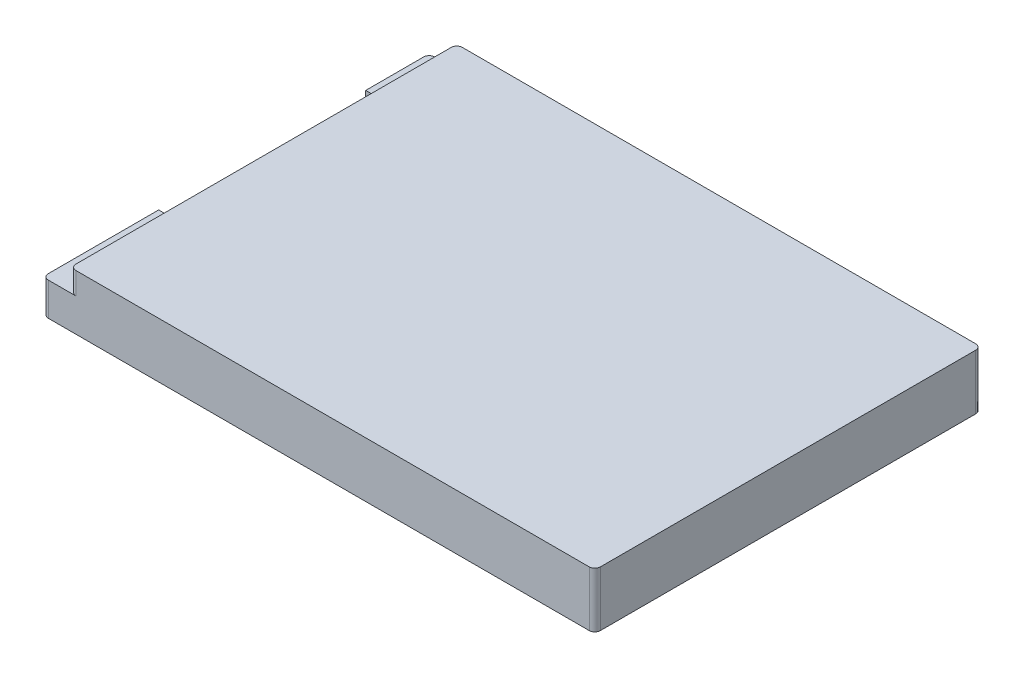
ISO-10303-21;
HEADER;
FILE_DESCRIPTION(('STEP AP214'),'2;1');
FILE_NAME('part.step','',(''),(''),'','','');
FILE_SCHEMA(('AUTOMOTIVE_DESIGN { 1 0 10303 214 1 1 1 1 }'));
ENDSEC;
DATA;
#1=APPLICATION_CONTEXT('core data for automotive mechanical design processes');
#2=APPLICATION_PROTOCOL_DEFINITION('international standard','automotive_design',2000,#1);
#3=PRODUCT_CONTEXT('',#1,'mechanical');
#4=PRODUCT('Part','Part','',(#3));
#5=PRODUCT_RELATED_PRODUCT_CATEGORY('part','',(#4));
#6=PRODUCT_DEFINITION_FORMATION('','',#4);
#7=PRODUCT_DEFINITION_CONTEXT('part definition',#1,'design');
#8=PRODUCT_DEFINITION('design','',#6,#7);
#9=PRODUCT_DEFINITION_SHAPE('','',#8);
#10=(LENGTH_UNIT() NAMED_UNIT(*) SI_UNIT(.MILLI.,.METRE.));
#11=(NAMED_UNIT(*) PLANE_ANGLE_UNIT() SI_UNIT($,.RADIAN.));
#12=(NAMED_UNIT(*) SI_UNIT($,.STERADIAN.) SOLID_ANGLE_UNIT());
#13=UNCERTAINTY_MEASURE_WITH_UNIT(LENGTH_MEASURE(1.E-05),#10,'distance_accuracy_value','');
#14=(GEOMETRIC_REPRESENTATION_CONTEXT(3) GLOBAL_UNCERTAINTY_ASSIGNED_CONTEXT((#13)) GLOBAL_UNIT_ASSIGNED_CONTEXT((#10,
#11,#12)) REPRESENTATION_CONTEXT('',''));
#15=CARTESIAN_POINT('',(0.,0.,0.));
#16=DIRECTION('',(0.,0.,1.));
#17=DIRECTION('',(1.,0.,0.));
#18=AXIS2_PLACEMENT_3D('',#15,#16,#17);
#19=CARTESIAN_POINT('',(0.,10.,0.));
#20=DIRECTION('',(1.,0.,0.));
#21=DIRECTION('',(0.,0.,-1.));
#22=AXIS2_PLACEMENT_3D('',#19,#20,#21);
#23=PLANE('',#22);
#24=DIRECTION('',(0.,0.,1.));
#25=VECTOR('',#24,1.);
#26=CARTESIAN_POINT('',(0.,0.,0.));
#27=LINE('',#26,#25);
#28=CARTESIAN_POINT('',(0.,0.,-21.));
#29=VERTEX_POINT('',#28);
#30=CARTESIAN_POINT('',(0.,0.,-1.));
#31=VERTEX_POINT('',#30);
#32=EDGE_CURVE('E336',#29,#31,#27,.T.);
#33=ORIENTED_EDGE('',*,*,#32,.T.);
#34=DIRECTION('',(0.,-1.,0.));
#35=VECTOR('',#34,1.);
#36=CARTESIAN_POINT('',(0.,10.,-1.));
#37=LINE('',#36,#35);
#38=CARTESIAN_POINT('',(0.,6.,-1.));
#39=VERTEX_POINT('',#38);
#40=EDGE_CURVE('E55',#31,#39,#37,.F.);
#41=ORIENTED_EDGE('',*,*,#40,.T.);
#42=DIRECTION('',(0.,0.,1.));
#43=VECTOR('',#42,1.);
#44=CARTESIAN_POINT('',(0.,6.,0.));
#45=LINE('',#44,#43);
#46=CARTESIAN_POINT('',(0.,6.,-21.));
#47=VERTEX_POINT('',#46);
#48=EDGE_CURVE('E277',#47,#39,#45,.T.);
#49=ORIENTED_EDGE('',*,*,#48,.F.);
#50=DIRECTION('',(0.,1.,0.));
#51=VECTOR('',#50,1.);
#52=CARTESIAN_POINT('',(0.,6.,-21.));
#53=LINE('',#52,#51);
#54=EDGE_CURVE('E296',#29,#47,#53,.T.);
#55=ORIENTED_EDGE('',*,*,#54,.F.);
#56=EDGE_LOOP('',(#33,#41,#49,#55));
#57=FACE_BOUND('',#56,.T.);
#58=ADVANCED_FACE('F32',(#57),#23,.F.);
#59=DIRECTION('',(0.,0.,1.));
#60=VECTOR('',#59,1.);
#61=CARTESIAN_POINT('',(0.,5.99999999999999,-58.5));
#62=LINE('',#61,#60);
#63=CARTESIAN_POINT('',(0.,5.99999999999999,-69.));
#64=VERTEX_POINT('',#63);
#65=CARTESIAN_POINT('',(0.,5.99999999999999,-58.5));
#66=VERTEX_POINT('',#65);
#67=EDGE_CURVE('E267',#64,#66,#62,.T.);
#68=ORIENTED_EDGE('',*,*,#67,.F.);
#69=DIRECTION('',(0.,-1.,0.));
#70=VECTOR('',#69,1.);
#71=CARTESIAN_POINT('',(0.,10.,-69.));
#72=LINE('',#71,#70);
#73=CARTESIAN_POINT('',(0.,0.,-69.));
#74=VERTEX_POINT('',#73);
#75=EDGE_CURVE('E404',#64,#74,#72,.T.);
#76=ORIENTED_EDGE('',*,*,#75,.T.);
#77=CARTESIAN_POINT('',(0.,0.,-58.5));
#78=VERTEX_POINT('',#77);
#79=EDGE_CURVE('E350',#74,#78,#27,.T.);
#80=ORIENTED_EDGE('',*,*,#79,.T.);
#81=DIRECTION('',(0.,-1.,0.));
#82=VECTOR('',#81,1.);
#83=CARTESIAN_POINT('',(0.,0.,-58.5));
#84=LINE('',#83,#82);
#85=EDGE_CURVE('E293',#66,#78,#84,.T.);
#86=ORIENTED_EDGE('',*,*,#85,.F.);
#87=EDGE_LOOP('',(#68,#76,#80,#86));
#88=FACE_BOUND('',#87,.T.);
#89=ADVANCED_FACE('F472',(#88),#23,.F.);
#90=CARTESIAN_POINT('',(0.,10.,0.));
#91=DIRECTION('',(0.,0.,-1.));
#92=DIRECTION('',(-1.,0.,0.));
#93=AXIS2_PLACEMENT_3D('',#90,#91,#92);
#94=PLANE('',#93);
#95=DIRECTION('',(1.,0.,0.));
#96=VECTOR('',#95,1.);
#97=CARTESIAN_POINT('',(0.,0.,0.));
#98=LINE('',#97,#96);
#99=CARTESIAN_POINT('',(1.,0.,0.));
#100=VERTEX_POINT('',#99);
#101=CARTESIAN_POINT('',(99.,0.,0.));
#102=VERTEX_POINT('',#101);
#103=EDGE_CURVE('E352',#100,#102,#98,.T.);
#104=ORIENTED_EDGE('',*,*,#103,.T.);
#105=DIRECTION('',(0.,-1.,0.));
#106=VECTOR('',#105,1.);
#107=CARTESIAN_POINT('',(99.,10.,0.));
#108=LINE('',#107,#106);
#109=CARTESIAN_POINT('',(99.,10.,0.));
#110=VERTEX_POINT('',#109);
#111=EDGE_CURVE('E393',#102,#110,#108,.F.);
#112=ORIENTED_EDGE('',*,*,#111,.T.);
#113=DIRECTION('',(1.,0.,0.));
#114=VECTOR('',#113,1.);
#115=CARTESIAN_POINT('',(0.,10.,0.));
#116=LINE('',#115,#114);
#117=CARTESIAN_POINT('',(6.,10.,0.));
#118=VERTEX_POINT('',#117);
#119=EDGE_CURVE('E339',#118,#110,#116,.T.);
#120=ORIENTED_EDGE('',*,*,#119,.F.);
#121=DIRECTION('',(0.,1.,0.));
#122=VECTOR('',#121,1.);
#123=CARTESIAN_POINT('',(6.,10.,0.));
#124=LINE('',#123,#122);
#125=CARTESIAN_POINT('',(6.,6.,0.));
#126=VERTEX_POINT('',#125);
#127=EDGE_CURVE('E390',#118,#126,#124,.F.);
#128=ORIENTED_EDGE('',*,*,#127,.T.);
#129=DIRECTION('',(-1.,0.,0.));
#130=VECTOR('',#129,1.);
#131=CARTESIAN_POINT('',(5.,6.,0.));
#132=LINE('',#131,#130);
#133=CARTESIAN_POINT('',(1.,6.,0.));
#134=VERTEX_POINT('',#133);
#135=EDGE_CURVE('E303',#126,#134,#132,.T.);
#136=ORIENTED_EDGE('',*,*,#135,.T.);
#137=DIRECTION('',(0.,-1.,0.));
#138=VECTOR('',#137,1.);
#139=CARTESIAN_POINT('',(1.,10.,0.));
#140=LINE('',#139,#138);
#141=EDGE_CURVE('E387',#134,#100,#140,.T.);
#142=ORIENTED_EDGE('',*,*,#141,.T.);
#143=EDGE_LOOP('',(#104,#112,#120,#128,#136,#142));
#144=FACE_BOUND('',#143,.T.);
#145=ADVANCED_FACE('F422',(#144),#94,.F.);
#146=CARTESIAN_POINT('',(100.,10.,0.));
#147=DIRECTION('',(-1.,0.,0.));
#148=DIRECTION('',(0.,0.,1.));
#149=AXIS2_PLACEMENT_3D('',#146,#147,#148);
#150=PLANE('',#149);
#151=DIRECTION('',(0.,0.,-1.));
#152=VECTOR('',#151,1.);
#153=CARTESIAN_POINT('',(100.,0.,0.));
#154=LINE('',#153,#152);
#155=CARTESIAN_POINT('',(100.,0.,-1.));
#156=VERTEX_POINT('',#155);
#157=CARTESIAN_POINT('',(100.,0.,-69.));
#158=VERTEX_POINT('',#157);
#159=EDGE_CURVE('E355',#156,#158,#154,.T.);
#160=ORIENTED_EDGE('',*,*,#159,.T.);
#161=DIRECTION('',(0.,-1.,0.));
#162=VECTOR('',#161,1.);
#163=CARTESIAN_POINT('',(100.,10.,-69.));
#164=LINE('',#163,#162);
#165=CARTESIAN_POINT('',(100.,10.,-69.));
#166=VERTEX_POINT('',#165);
#167=EDGE_CURVE('E377',#158,#166,#164,.F.);
#168=ORIENTED_EDGE('',*,*,#167,.T.);
#169=DIRECTION('',(0.,0.,-1.));
#170=VECTOR('',#169,1.);
#171=CARTESIAN_POINT('',(100.,10.,0.));
#172=LINE('',#171,#170);
#173=CARTESIAN_POINT('',(100.,10.,-1.));
#174=VERTEX_POINT('',#173);
#175=EDGE_CURVE('E342',#174,#166,#172,.T.);
#176=ORIENTED_EDGE('',*,*,#175,.F.);
#177=DIRECTION('',(0.,-1.,0.));
#178=VECTOR('',#177,1.);
#179=CARTESIAN_POINT('',(100.,10.,-1.));
#180=LINE('',#179,#178);
#181=EDGE_CURVE('E374',#174,#156,#180,.T.);
#182=ORIENTED_EDGE('',*,*,#181,.T.);
#183=EDGE_LOOP('',(#160,#168,#176,#182));
#184=FACE_BOUND('',#183,.T.);
#185=ADVANCED_FACE('F431',(#184),#150,.F.);
#186=CARTESIAN_POINT('',(0.,10.,-70.));
#187=DIRECTION('',(0.,0.,1.));
#188=DIRECTION('',(1.,0.,0.));
#189=AXIS2_PLACEMENT_3D('',#186,#187,#188);
#190=PLANE('',#189);
#191=DIRECTION('',(-1.,0.,0.));
#192=VECTOR('',#191,1.);
#193=CARTESIAN_POINT('',(0.,10.,-70.));
#194=LINE('',#193,#192);
#195=CARTESIAN_POINT('',(99.,10.,-70.));
#196=VERTEX_POINT('',#195);
#197=CARTESIAN_POINT('',(6.,10.,-70.));
#198=VERTEX_POINT('',#197);
#199=EDGE_CURVE('E346',#196,#198,#194,.T.);
#200=ORIENTED_EDGE('',*,*,#199,.F.);
#201=DIRECTION('',(0.,-1.,0.));
#202=VECTOR('',#201,1.);
#203=CARTESIAN_POINT('',(99.,10.,-70.));
#204=LINE('',#203,#202);
#205=CARTESIAN_POINT('',(99.,0.,-70.));
#206=VERTEX_POINT('',#205);
#207=EDGE_CURVE('E363',#196,#206,#204,.T.);
#208=ORIENTED_EDGE('',*,*,#207,.T.);
#209=DIRECTION('',(-1.,0.,0.));
#210=VECTOR('',#209,1.);
#211=CARTESIAN_POINT('',(0.,0.,-70.));
#212=LINE('',#211,#210);
#213=CARTESIAN_POINT('',(1.,0.,-70.));
#214=VERTEX_POINT('',#213);
#215=EDGE_CURVE('E343',#206,#214,#212,.T.);
#216=ORIENTED_EDGE('',*,*,#215,.T.);
#217=DIRECTION('',(0.,-1.,0.));
#218=VECTOR('',#217,1.);
#219=CARTESIAN_POINT('',(1.,10.,-70.));
#220=LINE('',#219,#218);
#221=CARTESIAN_POINT('',(1.,5.99999999999999,-70.));
#222=VERTEX_POINT('',#221);
#223=EDGE_CURVE('E349',#214,#222,#220,.F.);
#224=ORIENTED_EDGE('',*,*,#223,.T.);
#225=DIRECTION('',(-1.,0.,0.));
#226=VECTOR('',#225,1.);
#227=CARTESIAN_POINT('',(5.,5.99999999999999,-70.));
#228=LINE('',#227,#226);
#229=CARTESIAN_POINT('',(6.,5.99999999999999,-70.));
#230=VERTEX_POINT('',#229);
#231=EDGE_CURVE('E300',#230,#222,#228,.T.);
#232=ORIENTED_EDGE('',*,*,#231,.F.);
#233=DIRECTION('',(0.,-1.,0.));
#234=VECTOR('',#233,1.);
#235=CARTESIAN_POINT('',(6.,10.,-70.));
#236=LINE('',#235,#234);
#237=EDGE_CURVE('E361',#230,#198,#236,.F.);
#238=ORIENTED_EDGE('',*,*,#237,.T.);
#239=EDGE_LOOP('',(#200,#208,#216,#224,#232,#238));
#240=FACE_BOUND('',#239,.T.);
#241=ADVANCED_FACE('F440',(#240),#190,.F.);
#242=CARTESIAN_POINT('',(0.,10.,-70.));
#243=DIRECTION('',(0.,-1.,0.));
#244=DIRECTION('',(0.,0.,-1.));
#245=AXIS2_PLACEMENT_3D('',#242,#243,#244);
#246=PLANE('',#245);
#247=ORIENTED_EDGE('',*,*,#175,.T.);
#248=CARTESIAN_POINT('',(99.,10.,-69.));
#249=DIRECTION('',(0.,-1.,0.));
#250=DIRECTION('',(0.,0.,-1.));
#251=AXIS2_PLACEMENT_3D('',#248,#249,#250);
#252=CIRCLE('',#251,1.);
#253=EDGE_CURVE('E385',#166,#196,#252,.F.);
#254=ORIENTED_EDGE('',*,*,#253,.T.);
#255=ORIENTED_EDGE('',*,*,#199,.T.);
#256=CARTESIAN_POINT('',(6.,10.,-69.));
#257=DIRECTION('',(0.,-1.,0.));
#258=DIRECTION('',(0.,0.,-1.));
#259=AXIS2_PLACEMENT_3D('',#256,#257,#258);
#260=CIRCLE('',#259,1.);
#261=CARTESIAN_POINT('',(5.,10.,-69.));
#262=VERTEX_POINT('',#261);
#263=EDGE_CURVE('E379',#198,#262,#260,.F.);
#264=ORIENTED_EDGE('',*,*,#263,.T.);
#265=DIRECTION('',(0.,0.,-1.));
#266=VECTOR('',#265,1.);
#267=CARTESIAN_POINT('',(5.,10.,-70.));
#268=LINE('',#267,#266);
#269=CARTESIAN_POINT('',(5.,10.,-1.));
#270=VERTEX_POINT('',#269);
#271=EDGE_CURVE('E288',#270,#262,#268,.T.);
#272=ORIENTED_EDGE('',*,*,#271,.F.);
#273=CARTESIAN_POINT('',(6.,10.,-1.));
#274=DIRECTION('',(0.,-1.,0.));
#275=DIRECTION('',(0.,0.,-1.));
#276=AXIS2_PLACEMENT_3D('',#273,#274,#275);
#277=CIRCLE('',#276,1.);
#278=EDGE_CURVE('E381',#270,#118,#277,.F.);
#279=ORIENTED_EDGE('',*,*,#278,.T.);
#280=ORIENTED_EDGE('',*,*,#119,.T.);
#281=CARTESIAN_POINT('',(99.,10.,-1.));
#282=DIRECTION('',(0.,-1.,0.));
#283=DIRECTION('',(0.,0.,-1.));
#284=AXIS2_PLACEMENT_3D('',#281,#282,#283);
#285=CIRCLE('',#284,1.);
#286=EDGE_CURVE('E383',#110,#174,#285,.F.);
#287=ORIENTED_EDGE('',*,*,#286,.T.);
#288=EDGE_LOOP('',(#247,#254,#255,#264,#272,#279,#280,#287));
#289=FACE_BOUND('',#288,.T.);
#290=ADVANCED_FACE('F419',(#289),#246,.F.);
#291=CARTESIAN_POINT('',(0.,0.,-70.));
#292=DIRECTION('',(0.,-1.,0.));
#293=DIRECTION('',(0.,0.,-1.));
#294=AXIS2_PLACEMENT_3D('',#291,#292,#293);
#295=PLANE('',#294);
#296=ORIENTED_EDGE('',*,*,#215,.F.);
#297=CARTESIAN_POINT('',(99.,0.,-69.));
#298=DIRECTION('',(0.,-1.,0.));
#299=DIRECTION('',(0.,0.,-1.));
#300=AXIS2_PLACEMENT_3D('',#297,#298,#299);
#301=CIRCLE('',#300,1.);
#302=EDGE_CURVE('E372',#206,#158,#301,.T.);
#303=ORIENTED_EDGE('',*,*,#302,.T.);
#304=ORIENTED_EDGE('',*,*,#159,.F.);
#305=CARTESIAN_POINT('',(99.,0.,-1.));
#306=DIRECTION('',(0.,-1.,0.));
#307=DIRECTION('',(0.,0.,-1.));
#308=AXIS2_PLACEMENT_3D('',#305,#306,#307);
#309=CIRCLE('',#308,1.);
#310=EDGE_CURVE('E370',#156,#102,#309,.T.);
#311=ORIENTED_EDGE('',*,*,#310,.T.);
#312=ORIENTED_EDGE('',*,*,#103,.F.);
#313=CARTESIAN_POINT('',(1.,0.,-1.));
#314=DIRECTION('',(0.,-1.,0.));
#315=DIRECTION('',(0.,0.,-1.));
#316=AXIS2_PLACEMENT_3D('',#313,#314,#315);
#317=CIRCLE('',#316,1.);
#318=EDGE_CURVE('E368',#100,#31,#317,.T.);
#319=ORIENTED_EDGE('',*,*,#318,.T.);
#320=ORIENTED_EDGE('',*,*,#32,.F.);
#321=DIRECTION('',(-1.,0.,0.));
#322=VECTOR('',#321,1.);
#323=CARTESIAN_POINT('',(5.,0.,-21.));
#324=LINE('',#323,#322);
#325=CARTESIAN_POINT('',(5.,0.,-21.));
#326=VERTEX_POINT('',#325);
#327=EDGE_CURVE('E308',#326,#29,#324,.T.);
#328=ORIENTED_EDGE('',*,*,#327,.F.);
#329=DIRECTION('',(0.,0.,1.));
#330=VECTOR('',#329,1.);
#331=CARTESIAN_POINT('',(5.,0.,-21.));
#332=LINE('',#331,#330);
#333=CARTESIAN_POINT('',(5.,0.,-58.5));
#334=VERTEX_POINT('',#333);
#335=EDGE_CURVE('E279',#334,#326,#332,.T.);
#336=ORIENTED_EDGE('',*,*,#335,.F.);
#337=DIRECTION('',(-1.,0.,0.));
#338=VECTOR('',#337,1.);
#339=CARTESIAN_POINT('',(5.,0.,-58.5));
#340=LINE('',#339,#338);
#341=EDGE_CURVE('E310',#334,#78,#340,.T.);
#342=ORIENTED_EDGE('',*,*,#341,.T.);
#343=ORIENTED_EDGE('',*,*,#79,.F.);
#344=CARTESIAN_POINT('',(1.,0.,-69.));
#345=DIRECTION('',(0.,-1.,0.));
#346=DIRECTION('',(0.,0.,-1.));
#347=AXIS2_PLACEMENT_3D('',#344,#345,#346);
#348=CIRCLE('',#347,1.);
#349=EDGE_CURVE('E366',#74,#214,#348,.T.);
#350=ORIENTED_EDGE('',*,*,#349,.T.);
#351=EDGE_LOOP('',(#296,#303,#304,#311,#312,#319,#320,#328,#336,#342,#343,#350));
#352=FACE_BOUND('',#351,.T.);
#353=CARTESIAN_POINT('',(91.,0.,-4.));
#354=DIRECTION('',(0.,-1.,0.));
#355=DIRECTION('',(0.,0.,-1.));
#356=AXIS2_PLACEMENT_3D('',#353,#354,#355);
#357=CIRCLE('',#356,1.5);
#358=CARTESIAN_POINT('',(91.,0.,-5.5));
#359=VERTEX_POINT('',#358);
#360=EDGE_CURVE('E302',#359,#359,#357,.T.);
#361=ORIENTED_EDGE('',*,*,#360,.F.);
#362=EDGE_LOOP('',(#361));
#363=FACE_BOUND('',#362,.T.);
#364=CARTESIAN_POINT('',(91.,0.,-66.));
#365=DIRECTION('',(0.,-1.,0.));
#366=DIRECTION('',(0.,0.,-1.));
#367=AXIS2_PLACEMENT_3D('',#364,#365,#366);
#368=CIRCLE('',#367,1.5);
#369=CARTESIAN_POINT('',(91.,0.,-67.5));
#370=VERTEX_POINT('',#369);
#371=EDGE_CURVE('E318',#370,#370,#368,.T.);
#372=ORIENTED_EDGE('',*,*,#371,.F.);
#373=EDGE_LOOP('',(#372));
#374=FACE_BOUND('',#373,.T.);
#375=CARTESIAN_POINT('',(14.,0.,-66.));
#376=DIRECTION('',(0.,-1.,0.));
#377=DIRECTION('',(0.,0.,-1.));
#378=AXIS2_PLACEMENT_3D('',#375,#376,#377);
#379=CIRCLE('',#378,1.5);
#380=CARTESIAN_POINT('',(14.,0.,-67.5));
#381=VERTEX_POINT('',#380);
#382=EDGE_CURVE('E324',#381,#381,#379,.T.);
#383=ORIENTED_EDGE('',*,*,#382,.F.);
#384=EDGE_LOOP('',(#383));
#385=FACE_BOUND('',#384,.T.);
#386=CARTESIAN_POINT('',(14.,0.,-4.));
#387=DIRECTION('',(0.,-1.,0.));
#388=DIRECTION('',(0.,0.,-1.));
#389=AXIS2_PLACEMENT_3D('',#386,#387,#388);
#390=CIRCLE('',#389,1.5);
#391=CARTESIAN_POINT('',(14.,0.,-5.5));
#392=VERTEX_POINT('',#391);
#393=EDGE_CURVE('E330',#392,#392,#390,.T.);
#394=ORIENTED_EDGE('',*,*,#393,.F.);
#395=EDGE_LOOP('',(#394));
#396=FACE_BOUND('',#395,.T.);
#397=ADVANCED_FACE('F458',(#352,#363,#374,#385,#396),#295,.T.);
#398=CARTESIAN_POINT('',(14.,5.,-4.));
#399=DIRECTION('',(0.,-1.,0.));
#400=DIRECTION('',(0.,0.,-1.));
#401=AXIS2_PLACEMENT_3D('',#398,#399,#400);
#402=CYLINDRICAL_SURFACE('',#401,1.5);
#403=CARTESIAN_POINT('',(14.,5.,-4.));
#404=DIRECTION('',(0.,-1.,0.));
#405=DIRECTION('',(0.,0.,-1.));
#406=AXIS2_PLACEMENT_3D('',#403,#404,#405);
#407=CIRCLE('',#406,1.5);
#408=CARTESIAN_POINT('',(14.,5.,-5.5));
#409=VERTEX_POINT('',#408);
#410=EDGE_CURVE('E333',#409,#409,#407,.T.);
#411=ORIENTED_EDGE('',*,*,#410,.F.);
#412=EDGE_LOOP('',(#411));
#413=FACE_BOUND('',#412,.T.);
#414=ORIENTED_EDGE('',*,*,#393,.T.);
#415=EDGE_LOOP('',(#414));
#416=FACE_BOUND('',#415,.T.);
#417=ADVANCED_FACE('F558',(#413,#416),#402,.F.);
#418=CARTESIAN_POINT('',(14.,5.,-4.));
#419=DIRECTION('',(0.,-1.,0.));
#420=DIRECTION('',(0.,0.,-1.));
#421=AXIS2_PLACEMENT_3D('',#418,#419,#420);
#422=PLANE('',#421);
#423=ORIENTED_EDGE('',*,*,#410,.T.);
#424=EDGE_LOOP('',(#423));
#425=FACE_BOUND('',#424,.T.);
#426=ADVANCED_FACE('F554',(#425),#422,.T.);
#427=CARTESIAN_POINT('',(14.,5.,-66.));
#428=DIRECTION('',(0.,-1.,0.));
#429=DIRECTION('',(0.,0.,-1.));
#430=AXIS2_PLACEMENT_3D('',#427,#428,#429);
#431=CYLINDRICAL_SURFACE('',#430,1.5);
#432=CARTESIAN_POINT('',(14.,5.,-66.));
#433=DIRECTION('',(0.,-1.,0.));
#434=DIRECTION('',(0.,0.,-1.));
#435=AXIS2_PLACEMENT_3D('',#432,#433,#434);
#436=CIRCLE('',#435,1.5);
#437=CARTESIAN_POINT('',(14.,5.,-67.5));
#438=VERTEX_POINT('',#437);
#439=EDGE_CURVE('E327',#438,#438,#436,.T.);
#440=ORIENTED_EDGE('',*,*,#439,.F.);
#441=EDGE_LOOP('',(#440));
#442=FACE_BOUND('',#441,.T.);
#443=ORIENTED_EDGE('',*,*,#382,.T.);
#444=EDGE_LOOP('',(#443));
#445=FACE_BOUND('',#444,.T.);
#446=ADVANCED_FACE('F550',(#442,#445),#431,.F.);
#447=CARTESIAN_POINT('',(14.,5.,-66.));
#448=DIRECTION('',(0.,-1.,0.));
#449=DIRECTION('',(0.,0.,-1.));
#450=AXIS2_PLACEMENT_3D('',#447,#448,#449);
#451=PLANE('',#450);
#452=ORIENTED_EDGE('',*,*,#439,.T.);
#453=EDGE_LOOP('',(#452));
#454=FACE_BOUND('',#453,.T.);
#455=ADVANCED_FACE('F546',(#454),#451,.T.);
#456=CARTESIAN_POINT('',(91.,5.,-66.));
#457=DIRECTION('',(0.,-1.,0.));
#458=DIRECTION('',(0.,0.,-1.));
#459=AXIS2_PLACEMENT_3D('',#456,#457,#458);
#460=CYLINDRICAL_SURFACE('',#459,1.5);
#461=CARTESIAN_POINT('',(91.,5.,-66.));
#462=DIRECTION('',(0.,-1.,0.));
#463=DIRECTION('',(0.,0.,-1.));
#464=AXIS2_PLACEMENT_3D('',#461,#462,#463);
#465=CIRCLE('',#464,1.5);
#466=CARTESIAN_POINT('',(91.,5.,-67.5));
#467=VERTEX_POINT('',#466);
#468=EDGE_CURVE('E321',#467,#467,#465,.T.);
#469=ORIENTED_EDGE('',*,*,#468,.F.);
#470=EDGE_LOOP('',(#469));
#471=FACE_BOUND('',#470,.T.);
#472=ORIENTED_EDGE('',*,*,#371,.T.);
#473=EDGE_LOOP('',(#472));
#474=FACE_BOUND('',#473,.T.);
#475=ADVANCED_FACE('F542',(#471,#474),#460,.F.);
#476=CARTESIAN_POINT('',(91.,5.,-66.));
#477=DIRECTION('',(0.,-1.,0.));
#478=DIRECTION('',(0.,0.,-1.));
#479=AXIS2_PLACEMENT_3D('',#476,#477,#478);
#480=PLANE('',#479);
#481=ORIENTED_EDGE('',*,*,#468,.T.);
#482=EDGE_LOOP('',(#481));
#483=FACE_BOUND('',#482,.T.);
#484=ADVANCED_FACE('F538',(#483),#480,.T.);
#485=CARTESIAN_POINT('',(91.,5.,-4.));
#486=DIRECTION('',(0.,-1.,0.));
#487=DIRECTION('',(0.,0.,-1.));
#488=AXIS2_PLACEMENT_3D('',#485,#486,#487);
#489=CYLINDRICAL_SURFACE('',#488,1.5);
#490=CARTESIAN_POINT('',(91.,5.,-4.));
#491=DIRECTION('',(0.,-1.,0.));
#492=DIRECTION('',(0.,0.,-1.));
#493=AXIS2_PLACEMENT_3D('',#490,#491,#492);
#494=CIRCLE('',#493,1.5);
#495=CARTESIAN_POINT('',(91.,5.,-5.5));
#496=VERTEX_POINT('',#495);
#497=EDGE_CURVE('E315',#496,#496,#494,.T.);
#498=ORIENTED_EDGE('',*,*,#497,.F.);
#499=EDGE_LOOP('',(#498));
#500=FACE_BOUND('',#499,.T.);
#501=ORIENTED_EDGE('',*,*,#360,.T.);
#502=EDGE_LOOP('',(#501));
#503=FACE_BOUND('',#502,.T.);
#504=ADVANCED_FACE('F534',(#500,#503),#489,.F.);
#505=CARTESIAN_POINT('',(91.,5.,-4.));
#506=DIRECTION('',(0.,-1.,0.));
#507=DIRECTION('',(0.,0.,-1.));
#508=AXIS2_PLACEMENT_3D('',#505,#506,#507);
#509=PLANE('',#508);
#510=ORIENTED_EDGE('',*,*,#497,.T.);
#511=EDGE_LOOP('',(#510));
#512=FACE_BOUND('',#511,.T.);
#513=ADVANCED_FACE('F531',(#512),#509,.T.);
#514=CARTESIAN_POINT('',(5.,5.99999999999999,-58.5));
#515=DIRECTION('',(0.,-1.,0.));
#516=DIRECTION('',(0.,0.,-1.));
#517=AXIS2_PLACEMENT_3D('',#514,#515,#516);
#518=PLANE('',#517);
#519=ORIENTED_EDGE('',*,*,#231,.T.);
#520=CARTESIAN_POINT('',(1.,5.99999999999999,-69.));
#521=DIRECTION('',(0.,-1.,0.));
#522=DIRECTION('',(0.,0.,-1.));
#523=AXIS2_PLACEMENT_3D('',#520,#521,#522);
#524=CIRCLE('',#523,1.);
#525=EDGE_CURVE('E47',#222,#64,#524,.F.);
#526=ORIENTED_EDGE('',*,*,#525,.T.);
#527=ORIENTED_EDGE('',*,*,#67,.T.);
#528=DIRECTION('',(-1.,0.,0.));
#529=VECTOR('',#528,1.);
#530=CARTESIAN_POINT('',(5.,5.99999999999999,-58.5));
#531=LINE('',#530,#529);
#532=CARTESIAN_POINT('',(5.,5.99999999999999,-58.5));
#533=VERTEX_POINT('',#532);
#534=EDGE_CURVE('E291',#533,#66,#531,.T.);
#535=ORIENTED_EDGE('',*,*,#534,.F.);
#536=DIRECTION('',(0.,0.,1.));
#537=VECTOR('',#536,1.);
#538=CARTESIAN_POINT('',(5.,5.99999999999999,-58.5));
#539=LINE('',#538,#537);
#540=CARTESIAN_POINT('',(5.,5.99999999999999,-69.));
#541=VERTEX_POINT('',#540);
#542=EDGE_CURVE('E274',#541,#533,#539,.T.);
#543=ORIENTED_EDGE('',*,*,#542,.F.);
#544=CARTESIAN_POINT('',(6.,5.99999999999999,-69.));
#545=DIRECTION('',(0.,-1.,0.));
#546=DIRECTION('',(0.,0.,-1.));
#547=AXIS2_PLACEMENT_3D('',#544,#545,#546);
#548=CIRCLE('',#547,1.);
#549=EDGE_CURVE('E11',#541,#230,#548,.T.);
#550=ORIENTED_EDGE('',*,*,#549,.T.);
#551=EDGE_LOOP('',(#519,#526,#527,#535,#543,#550));
#552=FACE_BOUND('',#551,.T.);
#553=ADVANCED_FACE('F448',(#552),#518,.F.);
#554=CARTESIAN_POINT('',(5.,6.,0.));
#555=DIRECTION('',(0.,-1.,0.));
#556=DIRECTION('',(0.,0.,-1.));
#557=AXIS2_PLACEMENT_3D('',#554,#555,#556);
#558=PLANE('',#557);
#559=ORIENTED_EDGE('',*,*,#48,.T.);
#560=CARTESIAN_POINT('',(1.,6.,-1.));
#561=DIRECTION('',(0.,-1.,0.));
#562=DIRECTION('',(0.,0.,-1.));
#563=AXIS2_PLACEMENT_3D('',#560,#561,#562);
#564=CIRCLE('',#563,1.);
#565=EDGE_CURVE('E402',#39,#134,#564,.F.);
#566=ORIENTED_EDGE('',*,*,#565,.T.);
#567=ORIENTED_EDGE('',*,*,#135,.F.);
#568=CARTESIAN_POINT('',(6.,6.,-1.));
#569=DIRECTION('',(0.,-1.,0.));
#570=DIRECTION('',(0.,0.,-1.));
#571=AXIS2_PLACEMENT_3D('',#568,#569,#570);
#572=CIRCLE('',#571,1.);
#573=CARTESIAN_POINT('',(5.,6.,-1.));
#574=VERTEX_POINT('',#573);
#575=EDGE_CURVE('E40',#126,#574,#572,.T.);
#576=ORIENTED_EDGE('',*,*,#575,.T.);
#577=DIRECTION('',(0.,0.,1.));
#578=VECTOR('',#577,1.);
#579=CARTESIAN_POINT('',(5.,6.,0.));
#580=LINE('',#579,#578);
#581=CARTESIAN_POINT('',(5.,6.,-21.));
#582=VERTEX_POINT('',#581);
#583=EDGE_CURVE('E285',#582,#574,#580,.T.);
#584=ORIENTED_EDGE('',*,*,#583,.F.);
#585=DIRECTION('',(-1.,0.,0.));
#586=VECTOR('',#585,1.);
#587=CARTESIAN_POINT('',(5.,6.,-21.));
#588=LINE('',#587,#586);
#589=EDGE_CURVE('E306',#582,#47,#588,.T.);
#590=ORIENTED_EDGE('',*,*,#589,.T.);
#591=EDGE_LOOP('',(#559,#566,#567,#576,#584,#590));
#592=FACE_BOUND('',#591,.T.);
#593=ADVANCED_FACE('F410',(#592),#558,.F.);
#594=CARTESIAN_POINT('',(5.,6.,-21.));
#595=DIRECTION('',(0.,0.,1.));
#596=DIRECTION('',(0.,-1.,0.));
#597=AXIS2_PLACEMENT_3D('',#594,#595,#596);
#598=PLANE('',#597);
#599=ORIENTED_EDGE('',*,*,#54,.T.);
#600=ORIENTED_EDGE('',*,*,#589,.F.);
#601=DIRECTION('',(0.,1.,0.));
#602=VECTOR('',#601,1.);
#603=CARTESIAN_POINT('',(5.,6.,-21.));
#604=LINE('',#603,#602);
#605=EDGE_CURVE('E282',#326,#582,#604,.T.);
#606=ORIENTED_EDGE('',*,*,#605,.F.);
#607=ORIENTED_EDGE('',*,*,#327,.T.);
#608=EDGE_LOOP('',(#599,#600,#606,#607));
#609=FACE_BOUND('',#608,.T.);
#610=ADVANCED_FACE('F462',(#609),#598,.F.);
#611=CARTESIAN_POINT('',(5.,0.,-58.5));
#612=DIRECTION('',(0.,0.,-1.));
#613=DIRECTION('',(-1.,0.,0.));
#614=AXIS2_PLACEMENT_3D('',#611,#612,#613);
#615=PLANE('',#614);
#616=ORIENTED_EDGE('',*,*,#85,.T.);
#617=ORIENTED_EDGE('',*,*,#341,.F.);
#618=DIRECTION('',(0.,-1.,0.));
#619=VECTOR('',#618,1.);
#620=CARTESIAN_POINT('',(5.,0.,-58.5));
#621=LINE('',#620,#619);
#622=EDGE_CURVE('E276',#533,#334,#621,.T.);
#623=ORIENTED_EDGE('',*,*,#622,.F.);
#624=ORIENTED_EDGE('',*,*,#534,.T.);
#625=EDGE_LOOP('',(#616,#617,#623,#624));
#626=FACE_BOUND('',#625,.T.);
#627=ADVANCED_FACE('F453',(#626),#615,.F.);
#628=CARTESIAN_POINT('',(5.,5.99999999999999,-70.));
#629=DIRECTION('',(1.,0.,0.));
#630=DIRECTION('',(0.,0.,-1.));
#631=AXIS2_PLACEMENT_3D('',#628,#629,#630);
#632=PLANE('',#631);
#633=DIRECTION('',(0.,-1.,0.));
#634=VECTOR('',#633,1.);
#635=CARTESIAN_POINT('',(5.,4.34767063535645,-33.5400247553208));
#636=LINE('',#635,#634);
#637=CARTESIAN_POINT('',(5.,4.34767063535645,-33.5400247553208));
#638=VERTEX_POINT('',#637);
#639=CARTESIAN_POINT('',(5.,3.29151833069488,-33.5400247553208));
#640=VERTEX_POINT('',#639);
#641=EDGE_CURVE('E215',#638,#640,#636,.T.);
#642=ORIENTED_EDGE('',*,*,#641,.F.);
#643=DIRECTION('',(0.,0.,-1.));
#644=VECTOR('',#643,1.);
#645=CARTESIAN_POINT('',(5.,4.34767063535645,-33.5400247553208));
#646=LINE('',#645,#644);
#647=CARTESIAN_POINT('',(5.,4.34767063535645,-24.5316668626192));
#648=VERTEX_POINT('',#647);
#649=EDGE_CURVE('E208',#648,#638,#646,.T.);
#650=ORIENTED_EDGE('',*,*,#649,.F.);
#651=DIRECTION('',(0.,1.,0.));
#652=VECTOR('',#651,1.);
#653=CARTESIAN_POINT('',(5.,4.34767063535645,-24.5316668626192));
#654=LINE('',#653,#652);
#655=CARTESIAN_POINT('',(5.,3.29151833069488,-24.5316668626192));
#656=VERTEX_POINT('',#655);
#657=EDGE_CURVE('E218',#656,#648,#654,.T.);
#658=ORIENTED_EDGE('',*,*,#657,.F.);
#659=DIRECTION('',(0.,0.,1.));
#660=VECTOR('',#659,1.);
#661=CARTESIAN_POINT('',(5.,3.29151833069488,-33.5400247553208));
#662=LINE('',#661,#660);
#663=EDGE_CURVE('E200',#640,#656,#662,.T.);
#664=ORIENTED_EDGE('',*,*,#663,.F.);
#665=EDGE_LOOP('',(#642,#650,#658,#664));
#666=FACE_BOUND('',#665,.T.);
#667=DIRECTION('',(0.,-1.,0.));
#668=VECTOR('',#667,1.);
#669=CARTESIAN_POINT('',(5.,4.34767063535645,-54.6009442423954));
#670=LINE('',#669,#668);
#671=CARTESIAN_POINT('',(5.,4.34767063535645,-54.6009442423954));
#672=VERTEX_POINT('',#671);
#673=CARTESIAN_POINT('',(5.,3.29151833069488,-54.6009442423954));
#674=VERTEX_POINT('',#673);
#675=EDGE_CURVE('E241',#672,#674,#670,.T.);
#676=ORIENTED_EDGE('',*,*,#675,.F.);
#677=DIRECTION('',(0.,0.,-1.));
#678=VECTOR('',#677,1.);
#679=CARTESIAN_POINT('',(5.,4.34767063535645,-54.6009442423954));
#680=LINE('',#679,#678);
#681=CARTESIAN_POINT('',(5.,4.34767063535645,-37.0191147000883));
#682=VERTEX_POINT('',#681);
#683=EDGE_CURVE('E251',#682,#672,#680,.T.);
#684=ORIENTED_EDGE('',*,*,#683,.F.);
#685=DIRECTION('',(0.,1.,0.));
#686=VECTOR('',#685,1.);
#687=CARTESIAN_POINT('',(5.,4.34767063535645,-37.0191147000883));
#688=LINE('',#687,#686);
#689=CARTESIAN_POINT('',(5.,3.29151833069488,-37.0191147000883));
#690=VERTEX_POINT('',#689);
#691=EDGE_CURVE('E248',#690,#682,#688,.T.);
#692=ORIENTED_EDGE('',*,*,#691,.F.);
#693=DIRECTION('',(0.,0.,1.));
#694=VECTOR('',#693,1.);
#695=CARTESIAN_POINT('',(5.,3.29151833069488,-54.6009442423954));
#696=LINE('',#695,#694);
#697=EDGE_CURVE('E244',#674,#690,#696,.T.);
#698=ORIENTED_EDGE('',*,*,#697,.F.);
#699=EDGE_LOOP('',(#676,#684,#692,#698));
#700=FACE_BOUND('',#699,.T.);
#701=ORIENTED_EDGE('',*,*,#583,.T.);
#702=DIRECTION('',(0.,1.,0.));
#703=VECTOR('',#702,1.);
#704=CARTESIAN_POINT('',(5.,5.99999999999999,-1.));
#705=LINE('',#704,#703);
#706=EDGE_CURVE('E398',#574,#270,#705,.T.);
#707=ORIENTED_EDGE('',*,*,#706,.T.);
#708=ORIENTED_EDGE('',*,*,#271,.T.);
#709=DIRECTION('',(0.,-1.,0.));
#710=VECTOR('',#709,1.);
#711=CARTESIAN_POINT('',(5.,5.99999999999999,-69.));
#712=LINE('',#711,#710);
#713=EDGE_CURVE('E395',#262,#541,#712,.T.);
#714=ORIENTED_EDGE('',*,*,#713,.T.);
#715=ORIENTED_EDGE('',*,*,#542,.T.);
#716=ORIENTED_EDGE('',*,*,#622,.T.);
#717=ORIENTED_EDGE('',*,*,#335,.T.);
#718=ORIENTED_EDGE('',*,*,#605,.T.);
#719=EDGE_LOOP('',(#701,#707,#708,#714,#715,#716,#717,#718));
#720=FACE_BOUND('',#719,.T.);
#721=ADVANCED_FACE('F212',(#666,#700,#720),#632,.F.);
#722=CARTESIAN_POINT('',(5.,4.34767063535645,-54.6009442423954));
#723=DIRECTION('',(0.,0.,-1.));
#724=DIRECTION('',(-1.,0.,0.));
#725=AXIS2_PLACEMENT_3D('',#722,#723,#724);
#726=PLANE('',#725);
#727=DIRECTION('',(0.,-1.,0.));
#728=VECTOR('',#727,1.);
#729=CARTESIAN_POINT('',(0.,4.34767063535645,-54.6009442423954));
#730=LINE('',#729,#728);
#731=CARTESIAN_POINT('',(0.,4.34767063535645,-54.6009442423954));
#732=VERTEX_POINT('',#731);
#733=CARTESIAN_POINT('',(0.,3.29151833069488,-54.6009442423954));
#734=VERTEX_POINT('',#733);
#735=EDGE_CURVE('E237',#732,#734,#730,.T.);
#736=ORIENTED_EDGE('',*,*,#735,.F.);
#737=DIRECTION('',(-1.,0.,0.));
#738=VECTOR('',#737,1.);
#739=CARTESIAN_POINT('',(5.,4.34767063535645,-54.6009442423954));
#740=LINE('',#739,#738);
#741=EDGE_CURVE('E265',#672,#732,#740,.T.);
#742=ORIENTED_EDGE('',*,*,#741,.F.);
#743=ORIENTED_EDGE('',*,*,#675,.T.);
#744=DIRECTION('',(-1.,0.,0.));
#745=VECTOR('',#744,1.);
#746=CARTESIAN_POINT('',(5.,3.29151833069488,-54.6009442423954));
#747=LINE('',#746,#745);
#748=EDGE_CURVE('E254',#674,#734,#747,.T.);
#749=ORIENTED_EDGE('',*,*,#748,.T.);
#750=EDGE_LOOP('',(#736,#742,#743,#749));
#751=FACE_BOUND('',#750,.T.);
#752=ADVANCED_FACE('F510',(#751),#726,.T.);
#753=CARTESIAN_POINT('',(5.,4.34767063535645,-54.6009442423954));
#754=DIRECTION('',(0.,1.,0.));
#755=DIRECTION('',(0.,0.,1.));
#756=AXIS2_PLACEMENT_3D('',#753,#754,#755);
#757=PLANE('',#756);
#758=DIRECTION('',(0.,0.,-1.));
#759=VECTOR('',#758,1.);
#760=CARTESIAN_POINT('',(0.,4.34767063535645,-54.6009442423954));
#761=LINE('',#760,#759);
#762=CARTESIAN_POINT('',(0.,4.34767063535645,-37.0191147000883));
#763=VERTEX_POINT('',#762);
#764=EDGE_CURVE('E245',#763,#732,#761,.T.);
#765=ORIENTED_EDGE('',*,*,#764,.F.);
#766=DIRECTION('',(-1.,0.,0.));
#767=VECTOR('',#766,1.);
#768=CARTESIAN_POINT('',(5.,4.34767063535645,-37.0191147000883));
#769=LINE('',#768,#767);
#770=EDGE_CURVE('E268',#682,#763,#769,.T.);
#771=ORIENTED_EDGE('',*,*,#770,.F.);
#772=ORIENTED_EDGE('',*,*,#683,.T.);
#773=ORIENTED_EDGE('',*,*,#741,.T.);
#774=EDGE_LOOP('',(#765,#771,#772,#773));
#775=FACE_BOUND('',#774,.T.);
#776=ADVANCED_FACE('F506',(#775),#757,.T.);
#777=CARTESIAN_POINT('',(5.,4.34767063535645,-37.0191147000883));
#778=DIRECTION('',(0.,0.,1.));
#779=DIRECTION('',(1.,0.,0.));
#780=AXIS2_PLACEMENT_3D('',#777,#778,#779);
#781=PLANE('',#780);
#782=DIRECTION('',(0.,1.,0.));
#783=VECTOR('',#782,1.);
#784=CARTESIAN_POINT('',(0.,4.34767063535645,-37.0191147000883));
#785=LINE('',#784,#783);
#786=CARTESIAN_POINT('',(0.,3.29151833069488,-37.0191147000883));
#787=VERTEX_POINT('',#786);
#788=EDGE_CURVE('E260',#787,#763,#785,.T.);
#789=ORIENTED_EDGE('',*,*,#788,.F.);
#790=DIRECTION('',(-1.,0.,0.));
#791=VECTOR('',#790,1.);
#792=CARTESIAN_POINT('',(5.,3.29151833069488,-37.0191147000883));
#793=LINE('',#792,#791);
#794=EDGE_CURVE('E270',#690,#787,#793,.T.);
#795=ORIENTED_EDGE('',*,*,#794,.F.);
#796=ORIENTED_EDGE('',*,*,#691,.T.);
#797=ORIENTED_EDGE('',*,*,#770,.T.);
#798=EDGE_LOOP('',(#789,#795,#796,#797));
#799=FACE_BOUND('',#798,.T.);
#800=ADVANCED_FACE('F509',(#799),#781,.T.);
#801=CARTESIAN_POINT('',(5.,3.29151833069488,-54.6009442423954));
#802=DIRECTION('',(0.,-1.,0.));
#803=DIRECTION('',(0.,0.,-1.));
#804=AXIS2_PLACEMENT_3D('',#801,#802,#803);
#805=PLANE('',#804);
#806=DIRECTION('',(0.,0.,1.));
#807=VECTOR('',#806,1.);
#808=CARTESIAN_POINT('',(0.,3.29151833069488,-54.6009442423954));
#809=LINE('',#808,#807);
#810=EDGE_CURVE('E257',#734,#787,#809,.T.);
#811=ORIENTED_EDGE('',*,*,#810,.F.);
#812=ORIENTED_EDGE('',*,*,#748,.F.);
#813=ORIENTED_EDGE('',*,*,#697,.T.);
#814=ORIENTED_EDGE('',*,*,#794,.T.);
#815=EDGE_LOOP('',(#811,#812,#813,#814));
#816=FACE_BOUND('',#815,.T.);
#817=ADVANCED_FACE('F505',(#816),#805,.T.);
#818=CARTESIAN_POINT('',(5.,4.34767063535645,-33.5400247553208));
#819=DIRECTION('',(0.,0.,-1.));
#820=DIRECTION('',(-1.,0.,0.));
#821=AXIS2_PLACEMENT_3D('',#818,#819,#820);
#822=PLANE('',#821);
#823=DIRECTION('',(0.,-1.,0.));
#824=VECTOR('',#823,1.);
#825=CARTESIAN_POINT('',(0.,4.34767063535645,-33.5400247553208));
#826=LINE('',#825,#824);
#827=CARTESIAN_POINT('',(0.,4.34767063535645,-33.5400247553208));
#828=VERTEX_POINT('',#827);
#829=CARTESIAN_POINT('',(0.,3.29151833069488,-33.5400247553208));
#830=VERTEX_POINT('',#829);
#831=EDGE_CURVE('E231',#828,#830,#826,.T.);
#832=ORIENTED_EDGE('',*,*,#831,.F.);
#833=DIRECTION('',(-1.,0.,0.));
#834=VECTOR('',#833,1.);
#835=CARTESIAN_POINT('',(5.,4.34767063535645,-33.5400247553208));
#836=LINE('',#835,#834);
#837=EDGE_CURVE('E222',#638,#828,#836,.T.);
#838=ORIENTED_EDGE('',*,*,#837,.F.);
#839=ORIENTED_EDGE('',*,*,#641,.T.);
#840=DIRECTION('',(-1.,0.,0.));
#841=VECTOR('',#840,1.);
#842=CARTESIAN_POINT('',(5.,3.29151833069488,-33.5400247553208));
#843=LINE('',#842,#841);
#844=EDGE_CURVE('E196',#640,#830,#843,.T.);
#845=ORIENTED_EDGE('',*,*,#844,.T.);
#846=EDGE_LOOP('',(#832,#838,#839,#845));
#847=FACE_BOUND('',#846,.T.);
#848=ADVANCED_FACE('F221',(#847),#822,.T.);
#849=CARTESIAN_POINT('',(5.,4.34767063535645,-33.5400247553208));
#850=DIRECTION('',(0.,1.,0.));
#851=DIRECTION('',(0.,0.,1.));
#852=AXIS2_PLACEMENT_3D('',#849,#850,#851);
#853=PLANE('',#852);
#854=DIRECTION('',(0.,0.,-1.));
#855=VECTOR('',#854,1.);
#856=CARTESIAN_POINT('',(0.,4.34767063535645,-33.5400247553208));
#857=LINE('',#856,#855);
#858=CARTESIAN_POINT('',(0.,4.34767063535645,-24.5316668626192));
#859=VERTEX_POINT('',#858);
#860=EDGE_CURVE('E223',#859,#828,#857,.T.);
#861=ORIENTED_EDGE('',*,*,#860,.F.);
#862=DIRECTION('',(-1.,0.,0.));
#863=VECTOR('',#862,1.);
#864=CARTESIAN_POINT('',(5.,4.34767063535645,-24.5316668626192));
#865=LINE('',#864,#863);
#866=EDGE_CURVE('E238',#648,#859,#865,.T.);
#867=ORIENTED_EDGE('',*,*,#866,.F.);
#868=ORIENTED_EDGE('',*,*,#649,.T.);
#869=ORIENTED_EDGE('',*,*,#837,.T.);
#870=EDGE_LOOP('',(#861,#867,#868,#869));
#871=FACE_BOUND('',#870,.T.);
#872=ADVANCED_FACE('F494',(#871),#853,.T.);
#873=CARTESIAN_POINT('',(5.,4.34767063535645,-24.5316668626192));
#874=DIRECTION('',(0.,0.,1.));
#875=DIRECTION('',(1.,0.,0.));
#876=AXIS2_PLACEMENT_3D('',#873,#874,#875);
#877=PLANE('',#876);
#878=DIRECTION('',(0.,1.,0.));
#879=VECTOR('',#878,1.);
#880=CARTESIAN_POINT('',(0.,4.34767063535645,-24.5316668626192));
#881=LINE('',#880,#879);
#882=CARTESIAN_POINT('',(0.,3.29151833069488,-24.5316668626192));
#883=VERTEX_POINT('',#882);
#884=EDGE_CURVE('E226',#883,#859,#881,.T.);
#885=ORIENTED_EDGE('',*,*,#884,.F.);
#886=DIRECTION('',(-1.,0.,0.));
#887=VECTOR('',#886,1.);
#888=CARTESIAN_POINT('',(5.,3.29151833069488,-24.5316668626192));
#889=LINE('',#888,#887);
#890=EDGE_CURVE('E207',#656,#883,#889,.T.);
#891=ORIENTED_EDGE('',*,*,#890,.F.);
#892=ORIENTED_EDGE('',*,*,#657,.T.);
#893=ORIENTED_EDGE('',*,*,#866,.T.);
#894=EDGE_LOOP('',(#885,#891,#892,#893));
#895=FACE_BOUND('',#894,.T.);
#896=ADVANCED_FACE('F490',(#895),#877,.T.);
#897=CARTESIAN_POINT('',(5.,3.29151833069488,-33.5400247553208));
#898=DIRECTION('',(0.,-1.,0.));
#899=DIRECTION('',(0.,0.,-1.));
#900=AXIS2_PLACEMENT_3D('',#897,#898,#899);
#901=PLANE('',#900);
#902=DIRECTION('',(0.,0.,1.));
#903=VECTOR('',#902,1.);
#904=CARTESIAN_POINT('',(0.,3.29151833069488,-33.5400247553208));
#905=LINE('',#904,#903);
#906=EDGE_CURVE('E202',#830,#883,#905,.T.);
#907=ORIENTED_EDGE('',*,*,#906,.F.);
#908=ORIENTED_EDGE('',*,*,#844,.F.);
#909=ORIENTED_EDGE('',*,*,#663,.T.);
#910=ORIENTED_EDGE('',*,*,#890,.T.);
#911=EDGE_LOOP('',(#907,#908,#909,#910));
#912=FACE_BOUND('',#911,.T.);
#913=ADVANCED_FACE('F198',(#912),#901,.T.);
#914=ORIENTED_EDGE('',*,*,#831,.T.);
#915=ORIENTED_EDGE('',*,*,#906,.T.);
#916=ORIENTED_EDGE('',*,*,#884,.T.);
#917=ORIENTED_EDGE('',*,*,#860,.T.);
#918=EDGE_LOOP('',(#914,#915,#916,#917));
#919=FACE_BOUND('',#918,.T.);
#920=ADVANCED_FACE('F475',(#919),#23,.F.);
#921=ORIENTED_EDGE('',*,*,#735,.T.);
#922=ORIENTED_EDGE('',*,*,#810,.T.);
#923=ORIENTED_EDGE('',*,*,#788,.T.);
#924=ORIENTED_EDGE('',*,*,#764,.T.);
#925=EDGE_LOOP('',(#921,#922,#923,#924));
#926=FACE_BOUND('',#925,.T.);
#927=ADVANCED_FACE('F481',(#926),#23,.F.);
#928=CARTESIAN_POINT('',(99.,10.,-69.));
#929=DIRECTION('',(0.,-1.,0.));
#930=DIRECTION('',(0.,0.,-1.));
#931=AXIS2_PLACEMENT_3D('',#928,#929,#930);
#932=CYLINDRICAL_SURFACE('',#931,1.);
#933=ORIENTED_EDGE('',*,*,#253,.F.);
#934=ORIENTED_EDGE('',*,*,#167,.F.);
#935=ORIENTED_EDGE('',*,*,#302,.F.);
#936=ORIENTED_EDGE('',*,*,#207,.F.);
#937=EDGE_LOOP('',(#933,#934,#935,#936));
#938=FACE_BOUND('',#937,.T.);
#939=ADVANCED_FACE('F435',(#938),#932,.T.);
#940=CARTESIAN_POINT('',(99.,10.,-1.));
#941=DIRECTION('',(0.,-1.,0.));
#942=DIRECTION('',(0.,0.,-1.));
#943=AXIS2_PLACEMENT_3D('',#940,#941,#942);
#944=CYLINDRICAL_SURFACE('',#943,1.);
#945=ORIENTED_EDGE('',*,*,#286,.F.);
#946=ORIENTED_EDGE('',*,*,#111,.F.);
#947=ORIENTED_EDGE('',*,*,#310,.F.);
#948=ORIENTED_EDGE('',*,*,#181,.F.);
#949=EDGE_LOOP('',(#945,#946,#947,#948));
#950=FACE_BOUND('',#949,.T.);
#951=ADVANCED_FACE('F426',(#950),#944,.T.);
#952=CARTESIAN_POINT('',(6.,5.99999999999999,-1.));
#953=DIRECTION('',(0.,1.,0.));
#954=DIRECTION('',(0.,0.,1.));
#955=AXIS2_PLACEMENT_3D('',#952,#953,#954);
#956=CYLINDRICAL_SURFACE('',#955,1.);
#957=ORIENTED_EDGE('',*,*,#575,.F.);
#958=ORIENTED_EDGE('',*,*,#127,.F.);
#959=ORIENTED_EDGE('',*,*,#278,.F.);
#960=ORIENTED_EDGE('',*,*,#706,.F.);
#961=EDGE_LOOP('',(#957,#958,#959,#960));
#962=FACE_BOUND('',#961,.T.);
#963=ADVANCED_FACE('F416',(#962),#956,.T.);
#964=CARTESIAN_POINT('',(1.,10.,-1.));
#965=DIRECTION('',(0.,-1.,0.));
#966=DIRECTION('',(0.,0.,-1.));
#967=AXIS2_PLACEMENT_3D('',#964,#965,#966);
#968=CYLINDRICAL_SURFACE('',#967,1.);
#969=ORIENTED_EDGE('',*,*,#565,.F.);
#970=ORIENTED_EDGE('',*,*,#40,.F.);
#971=ORIENTED_EDGE('',*,*,#318,.F.);
#972=ORIENTED_EDGE('',*,*,#141,.F.);
#973=EDGE_LOOP('',(#969,#970,#971,#972));
#974=FACE_BOUND('',#973,.T.);
#975=ADVANCED_FACE('F466',(#974),#968,.T.);
#976=CARTESIAN_POINT('',(6.,5.99999999999999,-69.));
#977=DIRECTION('',(0.,-1.,0.));
#978=DIRECTION('',(0.,0.,-1.));
#979=AXIS2_PLACEMENT_3D('',#976,#977,#978);
#980=CYLINDRICAL_SURFACE('',#979,1.);
#981=ORIENTED_EDGE('',*,*,#263,.F.);
#982=ORIENTED_EDGE('',*,*,#237,.F.);
#983=ORIENTED_EDGE('',*,*,#549,.F.);
#984=ORIENTED_EDGE('',*,*,#713,.F.);
#985=EDGE_LOOP('',(#981,#982,#983,#984));
#986=FACE_BOUND('',#985,.T.);
#987=ADVANCED_FACE('F444',(#986),#980,.T.);
#988=CARTESIAN_POINT('',(1.,10.,-69.));
#989=DIRECTION('',(0.,-1.,0.));
#990=DIRECTION('',(0.,0.,-1.));
#991=AXIS2_PLACEMENT_3D('',#988,#989,#990);
#992=CYLINDRICAL_SURFACE('',#991,1.);
#993=ORIENTED_EDGE('',*,*,#525,.F.);
#994=ORIENTED_EDGE('',*,*,#223,.F.);
#995=ORIENTED_EDGE('',*,*,#349,.F.);
#996=ORIENTED_EDGE('',*,*,#75,.F.);
#997=EDGE_LOOP('',(#993,#994,#995,#996));
#998=FACE_BOUND('',#997,.T.);
#999=ADVANCED_FACE('F34',(#998),#992,.T.);
#1000=CLOSED_SHELL('',(#58,#89,#145,#185,#241,#290,#397,#417,#426,#446,#455,#475,#484,#504,#513,
#553,#593,#610,#627,#721,#752,#776,#800,#817,#848,#872,#896,#913,#920,#927,#939,#951,#963,#975,
#987,#999));
#1001=MANIFOLD_SOLID_BREP('B2',#1000);
#1002=ADVANCED_BREP_SHAPE_REPRESENTATION('',(#18,#1001),#14);
#1003=SHAPE_DEFINITION_REPRESENTATION(#9,#1002);
ENDSEC;
END-ISO-10303-21;
